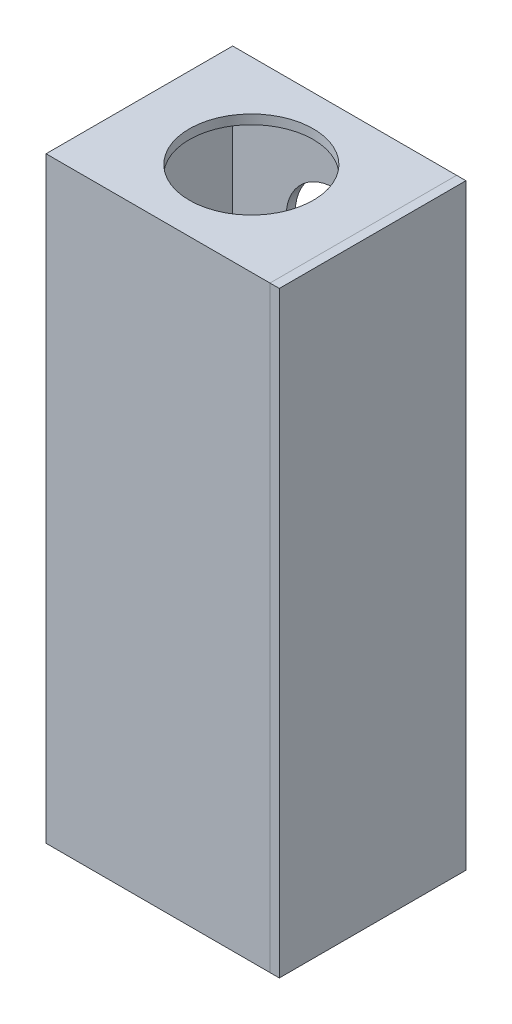
ISO-10303-21;
HEADER;
FILE_DESCRIPTION(('STEP AP214'),'2;1');
FILE_NAME('part.step','',(''),(''),'','','');
FILE_SCHEMA(('AUTOMOTIVE_DESIGN { 1 0 10303 214 1 1 1 1 }'));
ENDSEC;
DATA;
#1=APPLICATION_CONTEXT('core data for automotive mechanical design processes');
#2=APPLICATION_PROTOCOL_DEFINITION('international standard','automotive_design',2000,#1);
#3=PRODUCT_CONTEXT('',#1,'mechanical');
#4=PRODUCT('Part','Part','',(#3));
#5=PRODUCT_RELATED_PRODUCT_CATEGORY('part','',(#4));
#6=PRODUCT_DEFINITION_FORMATION('','',#4);
#7=PRODUCT_DEFINITION_CONTEXT('part definition',#1,'design');
#8=PRODUCT_DEFINITION('design','',#6,#7);
#9=PRODUCT_DEFINITION_SHAPE('','',#8);
#10=(LENGTH_UNIT() NAMED_UNIT(*) SI_UNIT(.MILLI.,.METRE.));
#11=(NAMED_UNIT(*) PLANE_ANGLE_UNIT() SI_UNIT($,.RADIAN.));
#12=(NAMED_UNIT(*) SI_UNIT($,.STERADIAN.) SOLID_ANGLE_UNIT());
#13=UNCERTAINTY_MEASURE_WITH_UNIT(LENGTH_MEASURE(1.E-05),#10,'distance_accuracy_value','');
#14=(GEOMETRIC_REPRESENTATION_CONTEXT(3) GLOBAL_UNCERTAINTY_ASSIGNED_CONTEXT((#13)) GLOBAL_UNIT_ASSIGNED_CONTEXT((#10,
#11,#12)) REPRESENTATION_CONTEXT('',''));
#15=CARTESIAN_POINT('',(0.,0.,0.));
#16=DIRECTION('',(0.,0.,1.));
#17=DIRECTION('',(1.,0.,0.));
#18=AXIS2_PLACEMENT_3D('',#15,#16,#17);
#19=CARTESIAN_POINT('',(79.375,203.2,0.));
#20=DIRECTION('',(0.,0.,-1.));
#21=DIRECTION('',(-1.,0.,0.));
#22=AXIS2_PLACEMENT_3D('',#19,#20,#21);
#23=PLANE('',#22);
#24=DIRECTION('',(0.,-1.,0.));
#25=VECTOR('',#24,1.);
#26=CARTESIAN_POINT('',(76.2,203.2,0.));
#27=LINE('',#26,#25);
#28=CARTESIAN_POINT('',(76.2,203.2,0.));
#29=VERTEX_POINT('',#28);
#30=CARTESIAN_POINT('',(76.2,0.,0.));
#31=VERTEX_POINT('',#30);
#32=EDGE_CURVE('E114',#29,#31,#27,.T.);
#33=ORIENTED_EDGE('',*,*,#32,.T.);
#34=DIRECTION('',(-1.,0.,0.));
#35=VECTOR('',#34,1.);
#36=CARTESIAN_POINT('',(79.375,0.,0.));
#37=LINE('',#36,#35);
#38=CARTESIAN_POINT('',(79.375,0.,0.));
#39=VERTEX_POINT('',#38);
#40=EDGE_CURVE('E12',#39,#31,#37,.T.);
#41=ORIENTED_EDGE('',*,*,#40,.F.);
#42=DIRECTION('',(0.,-1.,0.));
#43=VECTOR('',#42,1.);
#44=CARTESIAN_POINT('',(79.375,203.2,0.));
#45=LINE('',#44,#43);
#46=CARTESIAN_POINT('',(79.375,203.2,0.));
#47=VERTEX_POINT('',#46);
#48=EDGE_CURVE('E102',#47,#39,#45,.T.);
#49=ORIENTED_EDGE('',*,*,#48,.F.);
#50=DIRECTION('',(-1.,0.,0.));
#51=VECTOR('',#50,1.);
#52=CARTESIAN_POINT('',(79.375,203.2,0.));
#53=LINE('',#52,#51);
#54=EDGE_CURVE('E110',#47,#29,#53,.T.);
#55=ORIENTED_EDGE('',*,*,#54,.T.);
#56=EDGE_LOOP('',(#33,#41,#49,#55));
#57=FACE_BOUND('',#56,.T.);
#58=ADVANCED_FACE('F51',(#57),#23,.F.);
#59=CARTESIAN_POINT('',(79.375,0.,0.));
#60=DIRECTION('',(0.,1.,0.));
#61=DIRECTION('',(0.,0.,1.));
#62=AXIS2_PLACEMENT_3D('',#59,#60,#61);
#63=PLANE('',#62);
#64=DIRECTION('',(0.,0.,-1.));
#65=VECTOR('',#64,1.);
#66=CARTESIAN_POINT('',(76.2,0.,0.));
#67=LINE('',#66,#65);
#68=CARTESIAN_POINT('',(76.2,0.,-63.5));
#69=VERTEX_POINT('',#68);
#70=EDGE_CURVE('E106',#31,#69,#67,.T.);
#71=ORIENTED_EDGE('',*,*,#70,.T.);
#72=DIRECTION('',(-1.,0.,0.));
#73=VECTOR('',#72,1.);
#74=CARTESIAN_POINT('',(79.375,0.,-63.5));
#75=LINE('',#74,#73);
#76=CARTESIAN_POINT('',(79.375,0.,-63.5));
#77=VERTEX_POINT('',#76);
#78=EDGE_CURVE('E59',#77,#69,#75,.T.);
#79=ORIENTED_EDGE('',*,*,#78,.F.);
#80=DIRECTION('',(0.,0.,-1.));
#81=VECTOR('',#80,1.);
#82=CARTESIAN_POINT('',(79.375,0.,0.));
#83=LINE('',#82,#81);
#84=EDGE_CURVE('E97',#39,#77,#83,.T.);
#85=ORIENTED_EDGE('',*,*,#84,.F.);
#86=ORIENTED_EDGE('',*,*,#40,.T.);
#87=EDGE_LOOP('',(#71,#79,#85,#86));
#88=FACE_BOUND('',#87,.T.);
#89=ADVANCED_FACE('F105',(#88),#63,.F.);
#90=CARTESIAN_POINT('',(79.375,203.2,-63.5));
#91=DIRECTION('',(0.,0.,1.));
#92=DIRECTION('',(1.,0.,0.));
#93=AXIS2_PLACEMENT_3D('',#90,#91,#92);
#94=PLANE('',#93);
#95=DIRECTION('',(0.,1.,0.));
#96=VECTOR('',#95,1.);
#97=CARTESIAN_POINT('',(76.2,203.2,-63.5));
#98=LINE('',#97,#96);
#99=CARTESIAN_POINT('',(76.2,203.2,-63.5));
#100=VERTEX_POINT('',#99);
#101=EDGE_CURVE('E84',#69,#100,#98,.T.);
#102=ORIENTED_EDGE('',*,*,#101,.T.);
#103=DIRECTION('',(-1.,0.,0.));
#104=VECTOR('',#103,1.);
#105=CARTESIAN_POINT('',(79.375,203.2,-63.5));
#106=LINE('',#105,#104);
#107=CARTESIAN_POINT('',(79.375,203.2,-63.5));
#108=VERTEX_POINT('',#107);
#109=EDGE_CURVE('E107',#108,#100,#106,.T.);
#110=ORIENTED_EDGE('',*,*,#109,.F.);
#111=DIRECTION('',(0.,1.,0.));
#112=VECTOR('',#111,1.);
#113=CARTESIAN_POINT('',(79.375,203.2,-63.5));
#114=LINE('',#113,#112);
#115=EDGE_CURVE('E100',#77,#108,#114,.T.);
#116=ORIENTED_EDGE('',*,*,#115,.F.);
#117=ORIENTED_EDGE('',*,*,#78,.T.);
#118=EDGE_LOOP('',(#102,#110,#116,#117));
#119=FACE_BOUND('',#118,.T.);
#120=ADVANCED_FACE('F108',(#119),#94,.F.);
#121=CARTESIAN_POINT('',(79.375,203.2,0.));
#122=DIRECTION('',(0.,-1.,0.));
#123=DIRECTION('',(0.,0.,-1.));
#124=AXIS2_PLACEMENT_3D('',#121,#122,#123);
#125=PLANE('',#124);
#126=DIRECTION('',(0.,0.,1.));
#127=VECTOR('',#126,1.);
#128=CARTESIAN_POINT('',(76.2,203.2,0.));
#129=LINE('',#128,#127);
#130=EDGE_CURVE('E90',#100,#29,#129,.T.);
#131=ORIENTED_EDGE('',*,*,#130,.T.);
#132=ORIENTED_EDGE('',*,*,#54,.F.);
#133=DIRECTION('',(0.,0.,1.));
#134=VECTOR('',#133,1.);
#135=CARTESIAN_POINT('',(79.375,203.2,0.));
#136=LINE('',#135,#134);
#137=EDGE_CURVE('E67',#108,#47,#136,.T.);
#138=ORIENTED_EDGE('',*,*,#137,.F.);
#139=ORIENTED_EDGE('',*,*,#109,.T.);
#140=EDGE_LOOP('',(#131,#132,#138,#139));
#141=FACE_BOUND('',#140,.T.);
#142=ADVANCED_FACE('F121',(#141),#125,.F.);
#143=CARTESIAN_POINT('',(79.375,0.,0.));
#144=DIRECTION('',(1.,0.,0.));
#145=DIRECTION('',(0.,0.,-1.));
#146=AXIS2_PLACEMENT_3D('',#143,#144,#145);
#147=PLANE('',#146);
#148=ORIENTED_EDGE('',*,*,#48,.T.);
#149=ORIENTED_EDGE('',*,*,#84,.T.);
#150=ORIENTED_EDGE('',*,*,#115,.T.);
#151=ORIENTED_EDGE('',*,*,#137,.T.);
#152=EDGE_LOOP('',(#148,#149,#150,#151));
#153=FACE_BOUND('',#152,.T.);
#154=ADVANCED_FACE('F98',(#153),#147,.T.);
#155=CARTESIAN_POINT('',(76.2,0.,0.));
#156=DIRECTION('',(1.,0.,0.));
#157=DIRECTION('',(0.,0.,-1.));
#158=AXIS2_PLACEMENT_3D('',#155,#156,#157);
#159=PLANE('',#158);
#160=ORIENTED_EDGE('',*,*,#32,.F.);
#161=ORIENTED_EDGE('',*,*,#130,.F.);
#162=ORIENTED_EDGE('',*,*,#101,.F.);
#163=ORIENTED_EDGE('',*,*,#70,.F.);
#164=EDGE_LOOP('',(#160,#161,#162,#163));
#165=FACE_BOUND('',#164,.T.);
#166=ADVANCED_FACE('F124',(#165),#159,.F.);
#167=CLOSED_SHELL('',(#58,#89,#120,#142,#154,#166));
#168=MANIFOLD_SOLID_BREP('B2',#167);
#169=CARTESIAN_POINT('',(76.2,203.2,0.));
#170=DIRECTION('',(-1.,0.,0.));
#171=DIRECTION('',(0.,0.,1.));
#172=AXIS2_PLACEMENT_3D('',#169,#170,#171);
#173=PLANE('',#172);
#174=DIRECTION('',(0.,0.,-1.));
#175=VECTOR('',#174,1.);
#176=CARTESIAN_POINT('',(76.2,0.,0.));
#177=LINE('',#176,#175);
#178=CARTESIAN_POINT('',(76.2,0.,0.));
#179=VERTEX_POINT('',#178);
#180=CARTESIAN_POINT('',(76.2,0.,-63.5));
#181=VERTEX_POINT('',#180);
#182=EDGE_CURVE('E327',#179,#181,#177,.T.);
#183=ORIENTED_EDGE('',*,*,#182,.T.);
#184=DIRECTION('',(0.,-1.,0.));
#185=VECTOR('',#184,1.);
#186=CARTESIAN_POINT('',(76.2,203.2,-63.5));
#187=LINE('',#186,#185);
#188=CARTESIAN_POINT('',(76.2,203.2,-63.5));
#189=VERTEX_POINT('',#188);
#190=EDGE_CURVE('E334',#189,#181,#187,.T.);
#191=ORIENTED_EDGE('',*,*,#190,.F.);
#192=DIRECTION('',(0.,0.,-1.));
#193=VECTOR('',#192,1.);
#194=CARTESIAN_POINT('',(76.2,203.2,0.));
#195=LINE('',#194,#193);
#196=CARTESIAN_POINT('',(76.2,203.2,0.));
#197=VERTEX_POINT('',#196);
#198=EDGE_CURVE('E315',#197,#189,#195,.T.);
#199=ORIENTED_EDGE('',*,*,#198,.F.);
#200=DIRECTION('',(0.,-1.,0.));
#201=VECTOR('',#200,1.);
#202=CARTESIAN_POINT('',(76.2,203.2,0.));
#203=LINE('',#202,#201);
#204=EDGE_CURVE('E184',#197,#179,#203,.T.);
#205=ORIENTED_EDGE('',*,*,#204,.T.);
#206=EDGE_LOOP('',(#183,#191,#199,#205));
#207=FACE_BOUND('',#206,.T.);
#208=DIRECTION('',(0.,0.,-1.));
#209=VECTOR('',#208,1.);
#210=CARTESIAN_POINT('',(76.2,3.175,0.));
#211=LINE('',#210,#209);
#212=CARTESIAN_POINT('',(76.2,3.175,-3.175));
#213=VERTEX_POINT('',#212);
#214=CARTESIAN_POINT('',(76.2,3.175,-60.325));
#215=VERTEX_POINT('',#214);
#216=EDGE_CURVE('E261',#213,#215,#211,.T.);
#217=ORIENTED_EDGE('',*,*,#216,.F.);
#218=DIRECTION('',(0.,-1.,0.));
#219=VECTOR('',#218,1.);
#220=CARTESIAN_POINT('',(76.2,203.2,-3.175));
#221=LINE('',#220,#219);
#222=CARTESIAN_POINT('',(76.2,200.025,-3.175));
#223=VERTEX_POINT('',#222);
#224=EDGE_CURVE('E256',#223,#213,#221,.T.);
#225=ORIENTED_EDGE('',*,*,#224,.F.);
#226=DIRECTION('',(0.,0.,-1.));
#227=VECTOR('',#226,1.);
#228=CARTESIAN_POINT('',(76.2,200.025,0.));
#229=LINE('',#228,#227);
#230=CARTESIAN_POINT('',(76.2,200.025,-60.325));
#231=VERTEX_POINT('',#230);
#232=EDGE_CURVE('E191',#223,#231,#229,.T.);
#233=ORIENTED_EDGE('',*,*,#232,.T.);
#234=DIRECTION('',(0.,-1.,0.));
#235=VECTOR('',#234,1.);
#236=CARTESIAN_POINT('',(76.2,203.2,-60.325));
#237=LINE('',#236,#235);
#238=EDGE_CURVE('E292',#231,#215,#237,.T.);
#239=ORIENTED_EDGE('',*,*,#238,.T.);
#240=EDGE_LOOP('',(#217,#225,#233,#239));
#241=FACE_BOUND('',#240,.T.);
#242=ADVANCED_FACE('F175',(#207,#241),#173,.F.);
#243=CARTESIAN_POINT('',(0.,203.2,0.));
#244=DIRECTION('',(1.,0.,0.));
#245=DIRECTION('',(0.,0.,-1.));
#246=AXIS2_PLACEMENT_3D('',#243,#244,#245);
#247=PLANE('',#246);
#248=CARTESIAN_POINT('',(0.,31.75,-31.75));
#249=DIRECTION('',(-1.,0.,0.));
#250=DIRECTION('',(0.,0.,1.));
#251=AXIS2_PLACEMENT_3D('',#248,#249,#250);
#252=CIRCLE('',#251,16.764);
#253=CARTESIAN_POINT('',(0.,31.75,-14.986));
#254=VERTEX_POINT('',#253);
#255=EDGE_CURVE('E373',#254,#254,#252,.T.);
#256=ORIENTED_EDGE('',*,*,#255,.F.);
#257=EDGE_LOOP('',(#256));
#258=FACE_BOUND('',#257,.T.);
#259=DIRECTION('',(0.,0.,1.));
#260=VECTOR('',#259,1.);
#261=CARTESIAN_POINT('',(0.,0.,0.));
#262=LINE('',#261,#260);
#263=CARTESIAN_POINT('',(0.,0.,-63.5));
#264=VERTEX_POINT('',#263);
#265=CARTESIAN_POINT('',(0.,0.,0.));
#266=VERTEX_POINT('',#265);
#267=EDGE_CURVE('E272',#264,#266,#262,.T.);
#268=ORIENTED_EDGE('',*,*,#267,.T.);
#269=DIRECTION('',(0.,-1.,0.));
#270=VECTOR('',#269,1.);
#271=CARTESIAN_POINT('',(0.,203.2,0.));
#272=LINE('',#271,#270);
#273=CARTESIAN_POINT('',(0.,203.2,0.));
#274=VERTEX_POINT('',#273);
#275=EDGE_CURVE('E49',#274,#266,#272,.T.);
#276=ORIENTED_EDGE('',*,*,#275,.F.);
#277=DIRECTION('',(0.,0.,1.));
#278=VECTOR('',#277,1.);
#279=CARTESIAN_POINT('',(0.,203.2,0.));
#280=LINE('',#279,#278);
#281=CARTESIAN_POINT('',(0.,203.2,-63.5));
#282=VERTEX_POINT('',#281);
#283=EDGE_CURVE('E310',#282,#274,#280,.T.);
#284=ORIENTED_EDGE('',*,*,#283,.F.);
#285=DIRECTION('',(0.,-1.,0.));
#286=VECTOR('',#285,1.);
#287=CARTESIAN_POINT('',(0.,203.2,-63.5));
#288=LINE('',#287,#286);
#289=EDGE_CURVE('E320',#282,#264,#288,.T.);
#290=ORIENTED_EDGE('',*,*,#289,.T.);
#291=EDGE_LOOP('',(#268,#276,#284,#290));
#292=FACE_BOUND('',#291,.T.);
#293=ADVANCED_FACE('F177',(#258,#292),#247,.F.);
#294=CARTESIAN_POINT('',(0.,203.2,0.));
#295=DIRECTION('',(0.,0.,-1.));
#296=DIRECTION('',(-1.,0.,0.));
#297=AXIS2_PLACEMENT_3D('',#294,#295,#296);
#298=PLANE('',#297);
#299=DIRECTION('',(1.,0.,0.));
#300=VECTOR('',#299,1.);
#301=CARTESIAN_POINT('',(0.,0.,0.));
#302=LINE('',#301,#300);
#303=EDGE_CURVE('E324',#266,#179,#302,.T.);
#304=ORIENTED_EDGE('',*,*,#303,.T.);
#305=ORIENTED_EDGE('',*,*,#204,.F.);
#306=DIRECTION('',(1.,0.,0.));
#307=VECTOR('',#306,1.);
#308=CARTESIAN_POINT('',(0.,203.2,0.));
#309=LINE('',#308,#307);
#310=EDGE_CURVE('E228',#274,#197,#309,.T.);
#311=ORIENTED_EDGE('',*,*,#310,.F.);
#312=ORIENTED_EDGE('',*,*,#275,.T.);
#313=EDGE_LOOP('',(#304,#305,#311,#312));
#314=FACE_BOUND('',#313,.T.);
#315=ADVANCED_FACE('F352',(#314),#298,.F.);
#316=CARTESIAN_POINT('',(0.,203.2,-63.5));
#317=DIRECTION('',(0.,0.,1.));
#318=DIRECTION('',(1.,0.,0.));
#319=AXIS2_PLACEMENT_3D('',#316,#317,#318);
#320=PLANE('',#319);
#321=CARTESIAN_POINT('',(38.1,165.1,-63.5));
#322=DIRECTION('',(0.,0.,-1.));
#323=DIRECTION('',(-1.,0.,0.));
#324=AXIS2_PLACEMENT_3D('',#321,#322,#323);
#325=CIRCLE('',#324,16.764);
#326=CARTESIAN_POINT('',(21.336,165.1,-63.5));
#327=VERTEX_POINT('',#326);
#328=EDGE_CURVE('E382',#327,#327,#325,.T.);
#329=ORIENTED_EDGE('',*,*,#328,.F.);
#330=EDGE_LOOP('',(#329));
#331=FACE_BOUND('',#330,.T.);
#332=DIRECTION('',(-1.,0.,0.));
#333=VECTOR('',#332,1.);
#334=CARTESIAN_POINT('',(0.,0.,-63.5));
#335=LINE('',#334,#333);
#336=EDGE_CURVE('E221',#181,#264,#335,.T.);
#337=ORIENTED_EDGE('',*,*,#336,.T.);
#338=ORIENTED_EDGE('',*,*,#289,.F.);
#339=DIRECTION('',(-1.,0.,0.));
#340=VECTOR('',#339,1.);
#341=CARTESIAN_POINT('',(0.,203.2,-63.5));
#342=LINE('',#341,#340);
#343=EDGE_CURVE('E200',#189,#282,#342,.T.);
#344=ORIENTED_EDGE('',*,*,#343,.F.);
#345=ORIENTED_EDGE('',*,*,#190,.T.);
#346=EDGE_LOOP('',(#337,#338,#344,#345));
#347=FACE_BOUND('',#346,.T.);
#348=ADVANCED_FACE('F349',(#331,#347),#320,.F.);
#349=CARTESIAN_POINT('',(0.,203.2,0.));
#350=DIRECTION('',(0.,-1.,0.));
#351=DIRECTION('',(0.,0.,-1.));
#352=AXIS2_PLACEMENT_3D('',#349,#350,#351);
#353=PLANE('',#352);
#354=CARTESIAN_POINT('',(38.1,203.2,-31.75));
#355=DIRECTION('',(0.,1.,0.));
#356=DIRECTION('',(0.,0.,1.));
#357=AXIS2_PLACEMENT_3D('',#354,#355,#356);
#358=CIRCLE('',#357,21.082);
#359=CARTESIAN_POINT('',(38.1,203.2,-10.668));
#360=VERTEX_POINT('',#359);
#361=EDGE_CURVE('E279',#360,#360,#358,.T.);
#362=ORIENTED_EDGE('',*,*,#361,.F.);
#363=EDGE_LOOP('',(#362));
#364=FACE_BOUND('',#363,.T.);
#365=ORIENTED_EDGE('',*,*,#283,.T.);
#366=ORIENTED_EDGE('',*,*,#310,.T.);
#367=ORIENTED_EDGE('',*,*,#198,.T.);
#368=ORIENTED_EDGE('',*,*,#343,.T.);
#369=EDGE_LOOP('',(#365,#366,#367,#368));
#370=FACE_BOUND('',#369,.T.);
#371=ADVANCED_FACE('F351',(#364,#370),#353,.F.);
#372=CARTESIAN_POINT('',(0.,0.,0.));
#373=DIRECTION('',(0.,-1.,0.));
#374=DIRECTION('',(0.,0.,-1.));
#375=AXIS2_PLACEMENT_3D('',#372,#373,#374);
#376=PLANE('',#375);
#377=ORIENTED_EDGE('',*,*,#267,.F.);
#378=ORIENTED_EDGE('',*,*,#336,.F.);
#379=ORIENTED_EDGE('',*,*,#182,.F.);
#380=ORIENTED_EDGE('',*,*,#303,.F.);
#381=EDGE_LOOP('',(#377,#378,#379,#380));
#382=FACE_BOUND('',#381,.T.);
#383=ADVANCED_FACE('F345',(#382),#376,.T.);
#384=CARTESIAN_POINT('',(3.175,203.2,0.));
#385=DIRECTION('',(1.,0.,0.));
#386=DIRECTION('',(0.,0.,-1.));
#387=AXIS2_PLACEMENT_3D('',#384,#385,#386);
#388=PLANE('',#387);
#389=CARTESIAN_POINT('',(3.175,31.75,-31.75));
#390=DIRECTION('',(1.,0.,0.));
#391=DIRECTION('',(0.,0.,-1.));
#392=AXIS2_PLACEMENT_3D('',#389,#390,#391);
#393=CIRCLE('',#392,16.764);
#394=CARTESIAN_POINT('',(3.175,31.75,-48.514));
#395=VERTEX_POINT('',#394);
#396=EDGE_CURVE('E377',#395,#395,#393,.F.);
#397=ORIENTED_EDGE('',*,*,#396,.T.);
#398=EDGE_LOOP('',(#397));
#399=FACE_BOUND('',#398,.T.);
#400=DIRECTION('',(0.,0.,1.));
#401=VECTOR('',#400,1.);
#402=CARTESIAN_POINT('',(3.175,3.175,0.));
#403=LINE('',#402,#401);
#404=CARTESIAN_POINT('',(3.175,3.175,-60.325));
#405=VERTEX_POINT('',#404);
#406=CARTESIAN_POINT('',(3.175,3.175,-3.175));
#407=VERTEX_POINT('',#406);
#408=EDGE_CURVE('E262',#405,#407,#403,.T.);
#409=ORIENTED_EDGE('',*,*,#408,.F.);
#410=DIRECTION('',(0.,-1.,0.));
#411=VECTOR('',#410,1.);
#412=CARTESIAN_POINT('',(3.175,203.2,-60.325));
#413=LINE('',#412,#411);
#414=CARTESIAN_POINT('',(3.175,200.025,-60.325));
#415=VERTEX_POINT('',#414);
#416=EDGE_CURVE('E290',#415,#405,#413,.T.);
#417=ORIENTED_EDGE('',*,*,#416,.F.);
#418=DIRECTION('',(0.,0.,1.));
#419=VECTOR('',#418,1.);
#420=CARTESIAN_POINT('',(3.175,200.025,0.));
#421=LINE('',#420,#419);
#422=CARTESIAN_POINT('',(3.175,200.025,-3.175));
#423=VERTEX_POINT('',#422);
#424=EDGE_CURVE('E270',#415,#423,#421,.T.);
#425=ORIENTED_EDGE('',*,*,#424,.T.);
#426=DIRECTION('',(0.,-1.,0.));
#427=VECTOR('',#426,1.);
#428=CARTESIAN_POINT('',(3.175,203.2,-3.175));
#429=LINE('',#428,#427);
#430=EDGE_CURVE('E254',#423,#407,#429,.T.);
#431=ORIENTED_EDGE('',*,*,#430,.T.);
#432=EDGE_LOOP('',(#409,#417,#425,#431));
#433=FACE_BOUND('',#432,.T.);
#434=ADVANCED_FACE('F267',(#399,#433),#388,.T.);
#435=CARTESIAN_POINT('',(0.,203.2,-3.175));
#436=DIRECTION('',(0.,0.,-1.));
#437=DIRECTION('',(-1.,0.,0.));
#438=AXIS2_PLACEMENT_3D('',#435,#436,#437);
#439=PLANE('',#438);
#440=DIRECTION('',(1.,0.,0.));
#441=VECTOR('',#440,1.);
#442=CARTESIAN_POINT('',(0.,3.175,-3.175));
#443=LINE('',#442,#441);
#444=EDGE_CURVE('E251',#407,#213,#443,.T.);
#445=ORIENTED_EDGE('',*,*,#444,.F.);
#446=ORIENTED_EDGE('',*,*,#430,.F.);
#447=DIRECTION('',(1.,0.,0.));
#448=VECTOR('',#447,1.);
#449=CARTESIAN_POINT('',(0.,200.025,-3.175));
#450=LINE('',#449,#448);
#451=EDGE_CURVE('E289',#423,#223,#450,.T.);
#452=ORIENTED_EDGE('',*,*,#451,.T.);
#453=ORIENTED_EDGE('',*,*,#224,.T.);
#454=EDGE_LOOP('',(#445,#446,#452,#453));
#455=FACE_BOUND('',#454,.T.);
#456=ADVANCED_FACE('F253',(#455),#439,.T.);
#457=CARTESIAN_POINT('',(0.,203.2,-60.325));
#458=DIRECTION('',(0.,0.,1.));
#459=DIRECTION('',(1.,0.,0.));
#460=AXIS2_PLACEMENT_3D('',#457,#458,#459);
#461=PLANE('',#460);
#462=CARTESIAN_POINT('',(38.1,165.1,-60.325));
#463=DIRECTION('',(0.,0.,1.));
#464=DIRECTION('',(1.,0.,0.));
#465=AXIS2_PLACEMENT_3D('',#462,#463,#464);
#466=CIRCLE('',#465,16.764);
#467=CARTESIAN_POINT('',(54.864,165.1,-60.325));
#468=VERTEX_POINT('',#467);
#469=EDGE_CURVE('E376',#468,#468,#466,.F.);
#470=ORIENTED_EDGE('',*,*,#469,.T.);
#471=EDGE_LOOP('',(#470));
#472=FACE_BOUND('',#471,.T.);
#473=DIRECTION('',(-1.,0.,0.));
#474=VECTOR('',#473,1.);
#475=CARTESIAN_POINT('',(0.,3.175,-60.325));
#476=LINE('',#475,#474);
#477=EDGE_CURVE('E276',#215,#405,#476,.T.);
#478=ORIENTED_EDGE('',*,*,#477,.F.);
#479=ORIENTED_EDGE('',*,*,#238,.F.);
#480=DIRECTION('',(-1.,0.,0.));
#481=VECTOR('',#480,1.);
#482=CARTESIAN_POINT('',(0.,200.025,-60.325));
#483=LINE('',#482,#481);
#484=EDGE_CURVE('E293',#231,#415,#483,.T.);
#485=ORIENTED_EDGE('',*,*,#484,.T.);
#486=ORIENTED_EDGE('',*,*,#416,.T.);
#487=EDGE_LOOP('',(#478,#479,#485,#486));
#488=FACE_BOUND('',#487,.T.);
#489=ADVANCED_FACE('F416',(#472,#488),#461,.T.);
#490=CARTESIAN_POINT('',(0.,200.025,0.));
#491=DIRECTION('',(0.,-1.,0.));
#492=DIRECTION('',(0.,0.,-1.));
#493=AXIS2_PLACEMENT_3D('',#490,#491,#492);
#494=PLANE('',#493);
#495=CARTESIAN_POINT('',(38.1,200.025,-31.75));
#496=DIRECTION('',(0.,-1.,0.));
#497=DIRECTION('',(0.,0.,-1.));
#498=AXIS2_PLACEMENT_3D('',#495,#496,#497);
#499=CIRCLE('',#498,21.082);
#500=CARTESIAN_POINT('',(38.1,200.025,-52.832));
#501=VERTEX_POINT('',#500);
#502=EDGE_CURVE('E283',#501,#501,#499,.F.);
#503=ORIENTED_EDGE('',*,*,#502,.T.);
#504=EDGE_LOOP('',(#503));
#505=FACE_BOUND('',#504,.T.);
#506=ORIENTED_EDGE('',*,*,#424,.F.);
#507=ORIENTED_EDGE('',*,*,#484,.F.);
#508=ORIENTED_EDGE('',*,*,#232,.F.);
#509=ORIENTED_EDGE('',*,*,#451,.F.);
#510=EDGE_LOOP('',(#506,#507,#508,#509));
#511=FACE_BOUND('',#510,.T.);
#512=ADVANCED_FACE('F393',(#505,#511),#494,.T.);
#513=CARTESIAN_POINT('',(0.,3.175,0.));
#514=DIRECTION('',(0.,-1.,0.));
#515=DIRECTION('',(0.,0.,-1.));
#516=AXIS2_PLACEMENT_3D('',#513,#514,#515);
#517=PLANE('',#516);
#518=ORIENTED_EDGE('',*,*,#408,.T.);
#519=ORIENTED_EDGE('',*,*,#444,.T.);
#520=ORIENTED_EDGE('',*,*,#216,.T.);
#521=ORIENTED_EDGE('',*,*,#477,.T.);
#522=EDGE_LOOP('',(#518,#519,#520,#521));
#523=FACE_BOUND('',#522,.T.);
#524=ADVANCED_FACE('F274',(#523),#517,.F.);
#525=CARTESIAN_POINT('',(38.1,-0.001000000000001,-31.75));
#526=DIRECTION('',(0.,1.,0.));
#527=DIRECTION('',(0.,0.,1.));
#528=AXIS2_PLACEMENT_3D('',#525,#526,#527);
#529=CYLINDRICAL_SURFACE('',#528,21.082);
#530=ORIENTED_EDGE('',*,*,#502,.F.);
#531=EDGE_LOOP('',(#530));
#532=FACE_BOUND('',#531,.T.);
#533=ORIENTED_EDGE('',*,*,#361,.T.);
#534=EDGE_LOOP('',(#533));
#535=FACE_BOUND('',#534,.T.);
#536=ADVANCED_FACE('F395',(#532,#535),#529,.F.);
#537=CARTESIAN_POINT('',(38.1,165.1,0.001000000000001));
#538=DIRECTION('',(0.,0.,-1.));
#539=DIRECTION('',(-1.,0.,0.));
#540=AXIS2_PLACEMENT_3D('',#537,#538,#539);
#541=CYLINDRICAL_SURFACE('',#540,16.764);
#542=ORIENTED_EDGE('',*,*,#469,.F.);
#543=EDGE_LOOP('',(#542));
#544=FACE_BOUND('',#543,.T.);
#545=ORIENTED_EDGE('',*,*,#328,.T.);
#546=EDGE_LOOP('',(#545));
#547=FACE_BOUND('',#546,.T.);
#548=ADVANCED_FACE('F398',(#544,#547),#541,.F.);
#549=CARTESIAN_POINT('',(76.201,31.75,-31.75));
#550=DIRECTION('',(-1.,0.,0.));
#551=DIRECTION('',(0.,0.,1.));
#552=AXIS2_PLACEMENT_3D('',#549,#550,#551);
#553=CYLINDRICAL_SURFACE('',#552,16.764);
#554=ORIENTED_EDGE('',*,*,#396,.F.);
#555=EDGE_LOOP('',(#554));
#556=FACE_BOUND('',#555,.T.);
#557=ORIENTED_EDGE('',*,*,#255,.T.);
#558=EDGE_LOOP('',(#557));
#559=FACE_BOUND('',#558,.T.);
#560=ADVANCED_FACE('F405',(#556,#559),#553,.F.);
#561=CLOSED_SHELL('',(#242,#293,#315,#348,#371,#383,#434,#456,#489,#512,#524,#536,#548,#560));
#562=MANIFOLD_SOLID_BREP('B6',#561);
#563=ADVANCED_BREP_SHAPE_REPRESENTATION('',(#18,#168,#562),#14);
#564=SHAPE_DEFINITION_REPRESENTATION(#9,#563);
ENDSEC;
END-ISO-10303-21;
